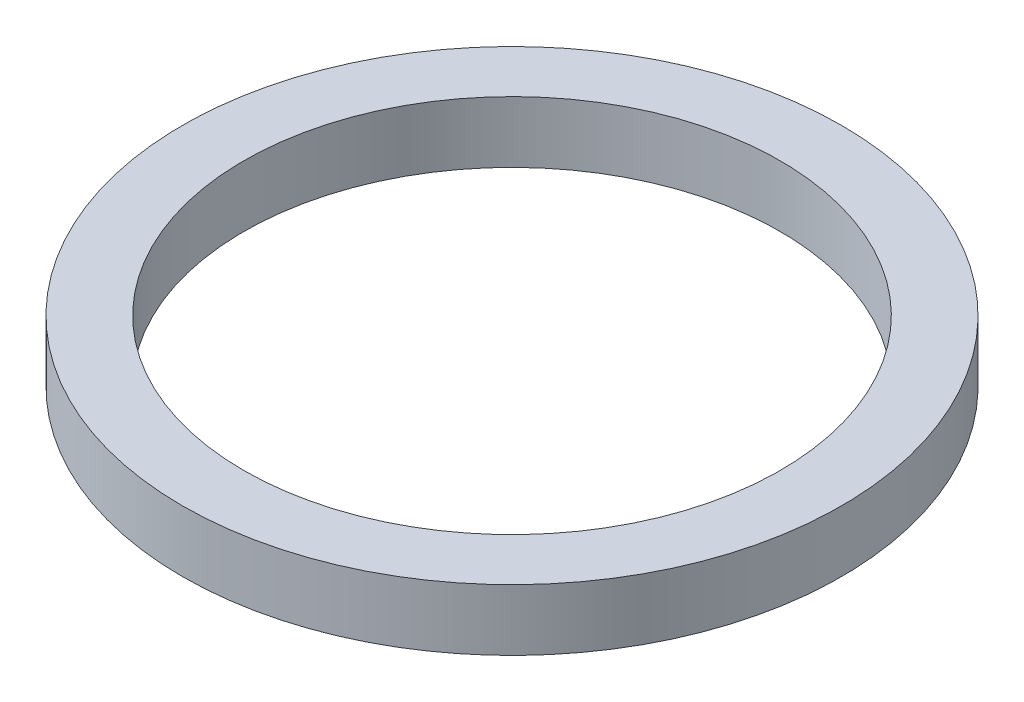
ISO-10303-21;
HEADER;
FILE_DESCRIPTION(('STEP AP214'),'2;1');
FILE_NAME('part.step','',(''),(''),'','','');
FILE_SCHEMA(('AUTOMOTIVE_DESIGN { 1 0 10303 214 1 1 1 1 }'));
ENDSEC;
DATA;
#1=APPLICATION_CONTEXT('core data for automotive mechanical design processes');
#2=APPLICATION_PROTOCOL_DEFINITION('international standard','automotive_design',2000,#1);
#3=PRODUCT_CONTEXT('',#1,'mechanical');
#4=PRODUCT('Part','Part','',(#3));
#5=PRODUCT_RELATED_PRODUCT_CATEGORY('part','',(#4));
#6=PRODUCT_DEFINITION_FORMATION('','',#4);
#7=PRODUCT_DEFINITION_CONTEXT('part definition',#1,'design');
#8=PRODUCT_DEFINITION('design','',#6,#7);
#9=PRODUCT_DEFINITION_SHAPE('','',#8);
#10=(LENGTH_UNIT() NAMED_UNIT(*) SI_UNIT(.MILLI.,.METRE.));
#11=(NAMED_UNIT(*) PLANE_ANGLE_UNIT() SI_UNIT($,.RADIAN.));
#12=(NAMED_UNIT(*) SI_UNIT($,.STERADIAN.) SOLID_ANGLE_UNIT());
#13=UNCERTAINTY_MEASURE_WITH_UNIT(LENGTH_MEASURE(1.E-05),#10,'distance_accuracy_value','');
#14=(GEOMETRIC_REPRESENTATION_CONTEXT(3) GLOBAL_UNCERTAINTY_ASSIGNED_CONTEXT((#13)) GLOBAL_UNIT_ASSIGNED_CONTEXT((#10,
#11,#12)) REPRESENTATION_CONTEXT('',''));
#15=CARTESIAN_POINT('',(0.,0.,0.));
#16=DIRECTION('',(0.,0.,1.));
#17=DIRECTION('',(1.,0.,0.));
#18=AXIS2_PLACEMENT_3D('',#15,#16,#17);
#19=CARTESIAN_POINT('',(0.,8.,0.));
#20=DIRECTION('',(0.,1.,0.));
#21=DIRECTION('',(0.,0.,1.));
#22=AXIS2_PLACEMENT_3D('',#19,#20,#21);
#23=PLANE('',#22);
#24=CARTESIAN_POINT('',(0.,8.,0.));
#25=DIRECTION('',(0.,1.,0.));
#26=DIRECTION('',(0.,0.,1.));
#27=AXIS2_PLACEMENT_3D('',#24,#25,#26);
#28=CIRCLE('',#27,43.);
#29=CARTESIAN_POINT('',(0.,8.,43.));
#30=VERTEX_POINT('',#29);
#31=EDGE_CURVE('E10',#30,#30,#28,.T.);
#32=ORIENTED_EDGE('',*,*,#31,.T.);
#33=EDGE_LOOP('',(#32));
#34=FACE_BOUND('',#33,.T.);
#35=CARTESIAN_POINT('',(0.,8.,0.));
#36=DIRECTION('',(0.,1.,0.));
#37=DIRECTION('',(0.,0.,1.));
#38=AXIS2_PLACEMENT_3D('',#35,#36,#37);
#39=CIRCLE('',#38,35.);
#40=CARTESIAN_POINT('',(0.,8.,35.));
#41=VERTEX_POINT('',#40);
#42=EDGE_CURVE('E43',#41,#41,#39,.T.);
#43=ORIENTED_EDGE('',*,*,#42,.F.);
#44=EDGE_LOOP('',(#43));
#45=FACE_BOUND('',#44,.T.);
#46=ADVANCED_FACE('F32',(#34,#45),#23,.T.);
#47=CARTESIAN_POINT('',(0.,0.,0.));
#48=DIRECTION('',(0.,1.,0.));
#49=DIRECTION('',(0.,0.,1.));
#50=AXIS2_PLACEMENT_3D('',#47,#48,#49);
#51=PLANE('',#50);
#52=CARTESIAN_POINT('',(0.,0.,0.));
#53=DIRECTION('',(0.,1.,0.));
#54=DIRECTION('',(0.,0.,1.));
#55=AXIS2_PLACEMENT_3D('',#52,#53,#54);
#56=CIRCLE('',#55,43.);
#57=CARTESIAN_POINT('',(0.,0.,43.));
#58=VERTEX_POINT('',#57);
#59=EDGE_CURVE('E36',#58,#58,#56,.T.);
#60=ORIENTED_EDGE('',*,*,#59,.F.);
#61=EDGE_LOOP('',(#60));
#62=FACE_BOUND('',#61,.T.);
#63=CARTESIAN_POINT('',(0.,0.,0.));
#64=DIRECTION('',(0.,1.,0.));
#65=DIRECTION('',(0.,0.,1.));
#66=AXIS2_PLACEMENT_3D('',#63,#64,#65);
#67=CIRCLE('',#66,35.);
#68=CARTESIAN_POINT('',(0.,0.,35.));
#69=VERTEX_POINT('',#68);
#70=EDGE_CURVE('E45',#69,#69,#67,.T.);
#71=ORIENTED_EDGE('',*,*,#70,.T.);
#72=EDGE_LOOP('',(#71));
#73=FACE_BOUND('',#72,.T.);
#74=ADVANCED_FACE('F55',(#62,#73),#51,.F.);
#75=CARTESIAN_POINT('',(0.,8.,0.));
#76=DIRECTION('',(0.,-1.,0.));
#77=DIRECTION('',(0.,0.,-1.));
#78=AXIS2_PLACEMENT_3D('',#75,#76,#77);
#79=CYLINDRICAL_SURFACE('',#78,43.);
#80=ORIENTED_EDGE('',*,*,#31,.F.);
#81=EDGE_LOOP('',(#80));
#82=FACE_BOUND('',#81,.T.);
#83=ORIENTED_EDGE('',*,*,#59,.T.);
#84=EDGE_LOOP('',(#83));
#85=FACE_BOUND('',#84,.T.);
#86=ADVANCED_FACE('F34',(#82,#85),#79,.T.);
#87=CARTESIAN_POINT('',(0.,8.,0.));
#88=DIRECTION('',(0.,-1.,0.));
#89=DIRECTION('',(0.,0.,-1.));
#90=AXIS2_PLACEMENT_3D('',#87,#88,#89);
#91=CYLINDRICAL_SURFACE('',#90,35.);
#92=ORIENTED_EDGE('',*,*,#42,.T.);
#93=EDGE_LOOP('',(#92));
#94=FACE_BOUND('',#93,.T.);
#95=ORIENTED_EDGE('',*,*,#70,.F.);
#96=EDGE_LOOP('',(#95));
#97=FACE_BOUND('',#96,.T.);
#98=ADVANCED_FACE('F51',(#94,#97),#91,.F.);
#99=CLOSED_SHELL('',(#46,#74,#86,#98));
#100=MANIFOLD_SOLID_BREP('B2',#99);
#101=ADVANCED_BREP_SHAPE_REPRESENTATION('',(#18,#100),#14);
#102=SHAPE_DEFINITION_REPRESENTATION(#9,#101);
ENDSEC;
END-ISO-10303-21;
